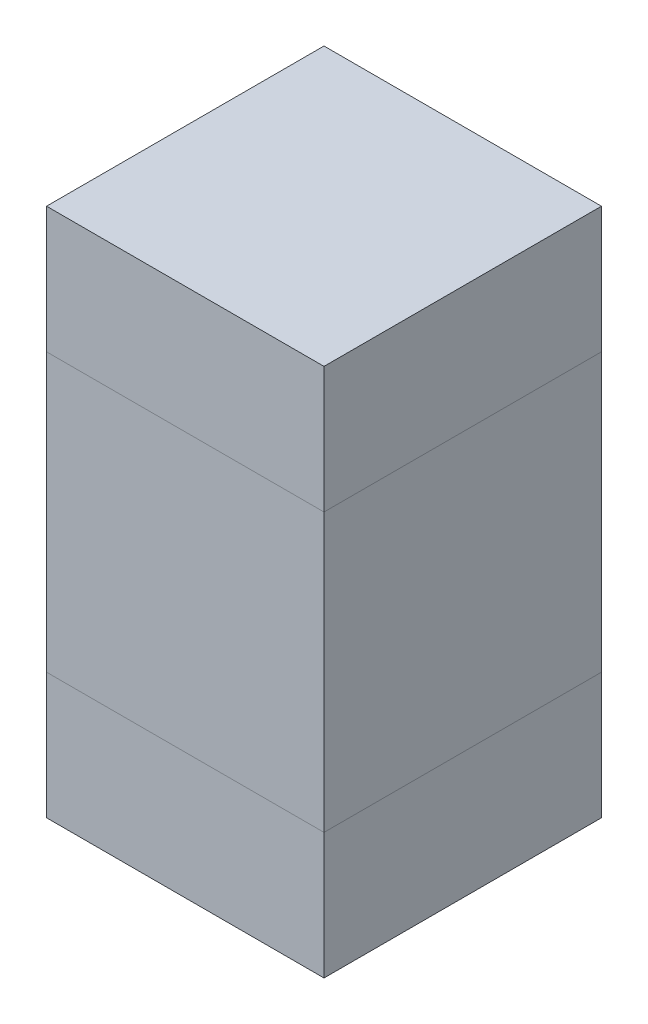
ISO-10303-21;
HEADER;
FILE_DESCRIPTION(('STEP AP214'),'2;1');
FILE_NAME('part.step','',(''),(''),'','','');
FILE_SCHEMA(('AUTOMOTIVE_DESIGN { 1 0 10303 214 1 1 1 1 }'));
ENDSEC;
DATA;
#1=APPLICATION_CONTEXT('core data for automotive mechanical design processes');
#2=APPLICATION_PROTOCOL_DEFINITION('international standard','automotive_design',2000,#1);
#3=PRODUCT_CONTEXT('',#1,'mechanical');
#4=PRODUCT('Part','Part','',(#3));
#5=PRODUCT_RELATED_PRODUCT_CATEGORY('part','',(#4));
#6=PRODUCT_DEFINITION_FORMATION('','',#4);
#7=PRODUCT_DEFINITION_CONTEXT('part definition',#1,'design');
#8=PRODUCT_DEFINITION('design','',#6,#7);
#9=PRODUCT_DEFINITION_SHAPE('','',#8);
#10=(LENGTH_UNIT() NAMED_UNIT(*) SI_UNIT(.MILLI.,.METRE.));
#11=(NAMED_UNIT(*) PLANE_ANGLE_UNIT() SI_UNIT($,.RADIAN.));
#12=(NAMED_UNIT(*) SI_UNIT($,.STERADIAN.) SOLID_ANGLE_UNIT());
#13=UNCERTAINTY_MEASURE_WITH_UNIT(LENGTH_MEASURE(1.E-05),#10,'distance_accuracy_value','');
#14=(GEOMETRIC_REPRESENTATION_CONTEXT(3) GLOBAL_UNCERTAINTY_ASSIGNED_CONTEXT((#13)) GLOBAL_UNIT_ASSIGNED_CONTEXT((#10,
#11,#12)) REPRESENTATION_CONTEXT('',''));
#15=CARTESIAN_POINT('',(0.,0.,0.));
#16=DIRECTION('',(0.,0.,1.));
#17=DIRECTION('',(1.,0.,0.));
#18=AXIS2_PLACEMENT_3D('',#15,#16,#17);
#19=CARTESIAN_POINT('',(3.210000129453,9.839999169844,0.32999934));
#20=DIRECTION('',(0.,0.,-1.));
#21=DIRECTION('',(0.,-1.,0.));
#22=AXIS2_PLACEMENT_3D('',#19,#20,#21);
#23=PLANE('',#22);
#24=DIRECTION('',(1.,0.,0.));
#25=VECTOR('',#24,1.);
#26=CARTESIAN_POINT('',(3.210000129453,9.839999169844,0.32999934));
#27=LINE('',#26,#25);
#28=CARTESIAN_POINT('',(3.210000129453,9.839999169844,0.32999934));
#29=VERTEX_POINT('',#28);
#30=CARTESIAN_POINT('',(3.540002009453,9.839999169844,0.32999934));
#31=VERTEX_POINT('',#30);
#32=EDGE_CURVE('P0_E93',#29,#31,#27,.T.);
#33=ORIENTED_EDGE('',*,*,#32,.T.);
#34=DIRECTION('',(0.,1.,0.));
#35=VECTOR('',#34,1.);
#36=CARTESIAN_POINT('',(3.540002009453,9.839999169844,0.32999934));
#37=LINE('',#36,#35);
#38=CARTESIAN_POINT('',(3.540002009453,9.989998869844,0.32999934));
#39=VERTEX_POINT('',#38);
#40=EDGE_CURVE('P0_E71',#31,#39,#37,.T.);
#41=ORIENTED_EDGE('',*,*,#40,.T.);
#42=DIRECTION('',(-1.,0.,0.));
#43=VECTOR('',#42,1.);
#44=CARTESIAN_POINT('',(3.540002009453,9.989998869844,0.32999934));
#45=LINE('',#44,#43);
#46=CARTESIAN_POINT('',(3.210000129453,9.989998869844,0.32999934));
#47=VERTEX_POINT('',#46);
#48=EDGE_CURVE('P0_E76',#39,#47,#45,.T.);
#49=ORIENTED_EDGE('',*,*,#48,.T.);
#50=DIRECTION('',(0.,-1.,0.));
#51=VECTOR('',#50,1.);
#52=CARTESIAN_POINT('',(3.210000129453,9.989998869844,0.32999934));
#53=LINE('',#52,#51);
#54=EDGE_CURVE('P0_E11',#47,#29,#53,.T.);
#55=ORIENTED_EDGE('',*,*,#54,.T.);
#56=EDGE_LOOP('',(#33,#41,#49,#55));
#57=FACE_BOUND('',#56,.T.);
#58=ADVANCED_FACE('P0_F17',(#57),#23,.F.);
#59=CARTESIAN_POINT('',(3.210000129453,9.839999169844,0.));
#60=DIRECTION('',(0.,0.,-1.));
#61=DIRECTION('',(0.,-1.,0.));
#62=AXIS2_PLACEMENT_3D('',#59,#60,#61);
#63=PLANE('',#62);
#64=DIRECTION('',(0.,-1.,0.));
#65=VECTOR('',#64,1.);
#66=CARTESIAN_POINT('',(3.210000129453,9.989998869844,0.));
#67=LINE('',#66,#65);
#68=CARTESIAN_POINT('',(3.210000129453,9.989998869844,0.));
#69=VERTEX_POINT('',#68);
#70=CARTESIAN_POINT('',(3.210000129453,9.839999169844,0.));
#71=VERTEX_POINT('',#70);
#72=EDGE_CURVE('P0_E25',#69,#71,#67,.T.);
#73=ORIENTED_EDGE('',*,*,#72,.F.);
#74=DIRECTION('',(-1.,0.,0.));
#75=VECTOR('',#74,1.);
#76=CARTESIAN_POINT('',(3.540002009453,9.989998869844,0.));
#77=LINE('',#76,#75);
#78=CARTESIAN_POINT('',(3.540002009453,9.989998869844,0.));
#79=VERTEX_POINT('',#78);
#80=EDGE_CURVE('P0_E60',#79,#69,#77,.T.);
#81=ORIENTED_EDGE('',*,*,#80,.F.);
#82=DIRECTION('',(0.,1.,0.));
#83=VECTOR('',#82,1.);
#84=CARTESIAN_POINT('',(3.540002009453,9.839999169844,0.));
#85=LINE('',#84,#83);
#86=CARTESIAN_POINT('',(3.540002009453,9.839999169844,0.));
#87=VERTEX_POINT('',#86);
#88=EDGE_CURVE('P0_E65',#87,#79,#85,.T.);
#89=ORIENTED_EDGE('',*,*,#88,.F.);
#90=DIRECTION('',(1.,0.,0.));
#91=VECTOR('',#90,1.);
#92=CARTESIAN_POINT('',(3.210000129453,9.839999169844,0.));
#93=LINE('',#92,#91);
#94=EDGE_CURVE('P0_E114',#71,#87,#93,.T.);
#95=ORIENTED_EDGE('',*,*,#94,.F.);
#96=EDGE_LOOP('',(#73,#81,#89,#95));
#97=FACE_BOUND('',#96,.T.);
#98=ADVANCED_FACE('P0_F62',(#97),#63,.T.);
#99=CARTESIAN_POINT('',(3.210000129453,9.989998869844,0.));
#100=DIRECTION('',(1.,0.,0.));
#101=DIRECTION('',(0.,1.,0.));
#102=AXIS2_PLACEMENT_3D('',#99,#100,#101);
#103=PLANE('',#102);
#104=ORIENTED_EDGE('',*,*,#72,.T.);
#105=DIRECTION('',(0.,0.,1.));
#106=VECTOR('',#105,1.);
#107=CARTESIAN_POINT('',(3.210000129453,9.839999169844,0.));
#108=LINE('',#107,#106);
#109=EDGE_CURVE('P0_E87',#71,#29,#108,.T.);
#110=ORIENTED_EDGE('',*,*,#109,.T.);
#111=ORIENTED_EDGE('',*,*,#54,.F.);
#112=DIRECTION('',(0.,0.,1.));
#113=VECTOR('',#112,1.);
#114=CARTESIAN_POINT('',(3.210000129453,9.989998869844,0.));
#115=LINE('',#114,#113);
#116=EDGE_CURVE('P0_E70',#69,#47,#115,.T.);
#117=ORIENTED_EDGE('',*,*,#116,.F.);
#118=EDGE_LOOP('',(#104,#110,#111,#117));
#119=FACE_BOUND('',#118,.T.);
#120=ADVANCED_FACE('P0_F106',(#119),#103,.F.);
#121=CARTESIAN_POINT('',(3.540002009453,9.989998869844,0.));
#122=DIRECTION('',(0.,-1.,0.));
#123=DIRECTION('',(0.,0.,-1.));
#124=AXIS2_PLACEMENT_3D('',#121,#122,#123);
#125=PLANE('',#124);
#126=ORIENTED_EDGE('',*,*,#80,.T.);
#127=ORIENTED_EDGE('',*,*,#116,.T.);
#128=ORIENTED_EDGE('',*,*,#48,.F.);
#129=DIRECTION('',(0.,0.,1.));
#130=VECTOR('',#129,1.);
#131=CARTESIAN_POINT('',(3.540002009453,9.989998869844,0.));
#132=LINE('',#131,#130);
#133=EDGE_CURVE('P0_E74',#79,#39,#132,.T.);
#134=ORIENTED_EDGE('',*,*,#133,.F.);
#135=EDGE_LOOP('',(#126,#127,#128,#134));
#136=FACE_BOUND('',#135,.T.);
#137=ADVANCED_FACE('P0_F75',(#136),#125,.F.);
#138=CARTESIAN_POINT('',(3.540002009453,9.839999169844,0.));
#139=DIRECTION('',(-1.,0.,0.));
#140=DIRECTION('',(0.,0.,1.));
#141=AXIS2_PLACEMENT_3D('',#138,#139,#140);
#142=PLANE('',#141);
#143=ORIENTED_EDGE('',*,*,#88,.T.);
#144=ORIENTED_EDGE('',*,*,#133,.T.);
#145=ORIENTED_EDGE('',*,*,#40,.F.);
#146=DIRECTION('',(0.,0.,1.));
#147=VECTOR('',#146,1.);
#148=CARTESIAN_POINT('',(3.540002009453,9.839999169844,0.));
#149=LINE('',#148,#147);
#150=EDGE_CURVE('P0_E84',#87,#31,#149,.T.);
#151=ORIENTED_EDGE('',*,*,#150,.F.);
#152=EDGE_LOOP('',(#143,#144,#145,#151));
#153=FACE_BOUND('',#152,.T.);
#154=ADVANCED_FACE('P0_F82',(#153),#142,.F.);
#155=CARTESIAN_POINT('',(3.210000129453,9.839999169844,0.));
#156=DIRECTION('',(0.,1.,0.));
#157=DIRECTION('',(1.,0.,0.));
#158=AXIS2_PLACEMENT_3D('',#155,#156,#157);
#159=PLANE('',#158);
#160=ORIENTED_EDGE('',*,*,#94,.T.);
#161=ORIENTED_EDGE('',*,*,#150,.T.);
#162=ORIENTED_EDGE('',*,*,#32,.F.);
#163=ORIENTED_EDGE('',*,*,#109,.F.);
#164=EDGE_LOOP('',(#160,#161,#162,#163));
#165=FACE_BOUND('',#164,.T.);
#166=ADVANCED_FACE('P0_F113',(#165),#159,.F.);
#167=CLOSED_SHELL('',(#58,#98,#120,#137,#154,#166));
#168=MANIFOLD_SOLID_BREP('P0_B1',#167);
#169=CARTESIAN_POINT('',(3.210000129453,9.360003442305,0.32999934));
#170=DIRECTION('',(0.,0.,-1.));
#171=DIRECTION('',(0.,-1.,0.));
#172=AXIS2_PLACEMENT_3D('',#169,#170,#171);
#173=PLANE('',#172);
#174=DIRECTION('',(1.,0.,0.));
#175=VECTOR('',#174,1.);
#176=CARTESIAN_POINT('',(3.210000129453,9.360003442305,0.32999934));
#177=LINE('',#176,#175);
#178=CARTESIAN_POINT('',(3.210000129453,9.360003442305,0.32999934));
#179=VERTEX_POINT('',#178);
#180=CARTESIAN_POINT('',(3.540002009453,9.360003442305,0.32999934));
#181=VERTEX_POINT('',#180);
#182=EDGE_CURVE('P1_E95',#179,#181,#177,.T.);
#183=ORIENTED_EDGE('',*,*,#182,.T.);
#184=DIRECTION('',(0.,1.,0.));
#185=VECTOR('',#184,1.);
#186=CARTESIAN_POINT('',(3.540002009453,9.360003442305,0.32999934));
#187=LINE('',#186,#185);
#188=CARTESIAN_POINT('',(3.540002009453,9.510003142305,0.32999934));
#189=VERTEX_POINT('',#188);
#190=EDGE_CURVE('P1_E74',#181,#189,#187,.T.);
#191=ORIENTED_EDGE('',*,*,#190,.T.);
#192=DIRECTION('',(-1.,0.,0.));
#193=VECTOR('',#192,1.);
#194=CARTESIAN_POINT('',(3.540002009453,9.510003142305,0.32999934));
#195=LINE('',#194,#193);
#196=CARTESIAN_POINT('',(3.210000129453,9.510003142305,0.32999934));
#197=VERTEX_POINT('',#196);
#198=EDGE_CURVE('P1_E79',#189,#197,#195,.T.);
#199=ORIENTED_EDGE('',*,*,#198,.T.);
#200=DIRECTION('',(0.,-1.,0.));
#201=VECTOR('',#200,1.);
#202=CARTESIAN_POINT('',(3.210000129453,9.510003142305,0.32999934));
#203=LINE('',#202,#201);
#204=EDGE_CURVE('P1_E11',#197,#179,#203,.T.);
#205=ORIENTED_EDGE('',*,*,#204,.T.);
#206=EDGE_LOOP('',(#183,#191,#199,#205));
#207=FACE_BOUND('',#206,.T.);
#208=ADVANCED_FACE('P1_F17',(#207),#173,.F.);
#209=CARTESIAN_POINT('',(3.210000129453,9.360003442305,0.));
#210=DIRECTION('',(0.,0.,-1.));
#211=DIRECTION('',(0.,-1.,0.));
#212=AXIS2_PLACEMENT_3D('',#209,#210,#211);
#213=PLANE('',#212);
#214=DIRECTION('',(0.,-1.,0.));
#215=VECTOR('',#214,1.);
#216=CARTESIAN_POINT('',(3.210000129453,9.510003142305,0.));
#217=LINE('',#216,#215);
#218=CARTESIAN_POINT('',(3.210000129453,9.510003142305,0.));
#219=VERTEX_POINT('',#218);
#220=CARTESIAN_POINT('',(3.210000129453,9.360003442305,0.));
#221=VERTEX_POINT('',#220);
#222=EDGE_CURVE('P1_E26',#219,#221,#217,.T.);
#223=ORIENTED_EDGE('',*,*,#222,.F.);
#224=DIRECTION('',(-1.,0.,0.));
#225=VECTOR('',#224,1.);
#226=CARTESIAN_POINT('',(3.540002009453,9.510003142305,0.));
#227=LINE('',#226,#225);
#228=CARTESIAN_POINT('',(3.540002009453,9.510003142305,0.));
#229=VERTEX_POINT('',#228);
#230=EDGE_CURVE('P1_E62',#229,#219,#227,.T.);
#231=ORIENTED_EDGE('',*,*,#230,.F.);
#232=DIRECTION('',(0.,1.,0.));
#233=VECTOR('',#232,1.);
#234=CARTESIAN_POINT('',(3.540002009453,9.360003442305,0.));
#235=LINE('',#234,#233);
#236=CARTESIAN_POINT('',(3.540002009453,9.360003442305,0.));
#237=VERTEX_POINT('',#236);
#238=EDGE_CURVE('P1_E67',#237,#229,#235,.T.);
#239=ORIENTED_EDGE('',*,*,#238,.F.);
#240=DIRECTION('',(1.,0.,0.));
#241=VECTOR('',#240,1.);
#242=CARTESIAN_POINT('',(3.210000129453,9.360003442305,0.));
#243=LINE('',#242,#241);
#244=EDGE_CURVE('P1_E111',#221,#237,#243,.T.);
#245=ORIENTED_EDGE('',*,*,#244,.F.);
#246=EDGE_LOOP('',(#223,#231,#239,#245));
#247=FACE_BOUND('',#246,.T.);
#248=ADVANCED_FACE('P1_F64',(#247),#213,.T.);
#249=CARTESIAN_POINT('',(3.210000129453,9.510003142305,0.));
#250=DIRECTION('',(1.,0.,0.));
#251=DIRECTION('',(0.,1.,0.));
#252=AXIS2_PLACEMENT_3D('',#249,#250,#251);
#253=PLANE('',#252);
#254=ORIENTED_EDGE('',*,*,#222,.T.);
#255=DIRECTION('',(0.,0.,1.));
#256=VECTOR('',#255,1.);
#257=CARTESIAN_POINT('',(3.210000129453,9.360003442305,0.));
#258=LINE('',#257,#256);
#259=EDGE_CURVE('P1_E89',#221,#179,#258,.T.);
#260=ORIENTED_EDGE('',*,*,#259,.T.);
#261=ORIENTED_EDGE('',*,*,#204,.F.);
#262=DIRECTION('',(0.,0.,1.));
#263=VECTOR('',#262,1.);
#264=CARTESIAN_POINT('',(3.210000129453,9.510003142305,0.));
#265=LINE('',#264,#263);
#266=EDGE_CURVE('P1_E73',#219,#197,#265,.T.);
#267=ORIENTED_EDGE('',*,*,#266,.F.);
#268=EDGE_LOOP('',(#254,#260,#261,#267));
#269=FACE_BOUND('',#268,.T.);
#270=ADVANCED_FACE('P1_F107',(#269),#253,.F.);
#271=CARTESIAN_POINT('',(3.540002009453,9.510003142305,0.));
#272=DIRECTION('',(0.,-1.,0.));
#273=DIRECTION('',(0.,0.,-1.));
#274=AXIS2_PLACEMENT_3D('',#271,#272,#273);
#275=PLANE('',#274);
#276=ORIENTED_EDGE('',*,*,#230,.T.);
#277=ORIENTED_EDGE('',*,*,#266,.T.);
#278=ORIENTED_EDGE('',*,*,#198,.F.);
#279=DIRECTION('',(0.,0.,1.));
#280=VECTOR('',#279,1.);
#281=CARTESIAN_POINT('',(3.540002009453,9.510003142305,0.));
#282=LINE('',#281,#280);
#283=EDGE_CURVE('P1_E77',#229,#189,#282,.T.);
#284=ORIENTED_EDGE('',*,*,#283,.F.);
#285=EDGE_LOOP('',(#276,#277,#278,#284));
#286=FACE_BOUND('',#285,.T.);
#287=ADVANCED_FACE('P1_F78',(#286),#275,.F.);
#288=CARTESIAN_POINT('',(3.540002009453,9.360003442305,0.));
#289=DIRECTION('',(-1.,0.,0.));
#290=DIRECTION('',(0.,0.,1.));
#291=AXIS2_PLACEMENT_3D('',#288,#289,#290);
#292=PLANE('',#291);
#293=ORIENTED_EDGE('',*,*,#238,.T.);
#294=ORIENTED_EDGE('',*,*,#283,.T.);
#295=ORIENTED_EDGE('',*,*,#190,.F.);
#296=DIRECTION('',(0.,0.,1.));
#297=VECTOR('',#296,1.);
#298=CARTESIAN_POINT('',(3.540002009453,9.360003442305,0.));
#299=LINE('',#298,#297);
#300=EDGE_CURVE('P1_E86',#237,#181,#299,.T.);
#301=ORIENTED_EDGE('',*,*,#300,.F.);
#302=EDGE_LOOP('',(#293,#294,#295,#301));
#303=FACE_BOUND('',#302,.T.);
#304=ADVANCED_FACE('P1_F84',(#303),#292,.F.);
#305=CARTESIAN_POINT('',(3.210000129453,9.360003442305,0.));
#306=DIRECTION('',(0.,1.,0.));
#307=DIRECTION('',(1.,0.,0.));
#308=AXIS2_PLACEMENT_3D('',#305,#306,#307);
#309=PLANE('',#308);
#310=ORIENTED_EDGE('',*,*,#244,.T.);
#311=ORIENTED_EDGE('',*,*,#300,.T.);
#312=ORIENTED_EDGE('',*,*,#182,.F.);
#313=ORIENTED_EDGE('',*,*,#259,.F.);
#314=EDGE_LOOP('',(#310,#311,#312,#313));
#315=FACE_BOUND('',#314,.T.);
#316=ADVANCED_FACE('P1_F110',(#315),#309,.F.);
#317=CLOSED_SHELL('',(#208,#248,#270,#287,#304,#316));
#318=MANIFOLD_SOLID_BREP('P1_B1',#317);
#319=CARTESIAN_POINT('',(3.210000129453,9.510001486074,0.32999934));
#320=DIRECTION('',(0.,0.,-1.));
#321=DIRECTION('',(0.,-1.,0.));
#322=AXIS2_PLACEMENT_3D('',#319,#320,#321);
#323=PLANE('',#322);
#324=DIRECTION('',(1.,0.,0.));
#325=VECTOR('',#324,1.);
#326=CARTESIAN_POINT('',(3.210000129453,9.510001486074,0.32999934));
#327=LINE('',#326,#325);
#328=CARTESIAN_POINT('',(3.210000129453,9.510001486074,0.32999934));
#329=VERTEX_POINT('',#328);
#330=CARTESIAN_POINT('',(3.540002009453,9.510001486074,0.32999934));
#331=VERTEX_POINT('',#330);
#332=EDGE_CURVE('P2_E83',#329,#331,#327,.T.);
#333=ORIENTED_EDGE('',*,*,#332,.T.);
#334=DIRECTION('',(0.,1.,0.));
#335=VECTOR('',#334,1.);
#336=CARTESIAN_POINT('',(3.540002009453,9.510001486074,0.32999934));
#337=LINE('',#336,#335);
#338=CARTESIAN_POINT('',(3.540002009453,9.840000826074,0.32999934));
#339=VERTEX_POINT('',#338);
#340=EDGE_CURVE('P2_E106',#331,#339,#337,.T.);
#341=ORIENTED_EDGE('',*,*,#340,.T.);
#342=DIRECTION('',(-1.,0.,0.));
#343=VECTOR('',#342,1.);
#344=CARTESIAN_POINT('',(3.540002009453,9.840000826074,0.32999934));
#345=LINE('',#344,#343);
#346=CARTESIAN_POINT('',(3.210000129453,9.840000826074,0.32999934));
#347=VERTEX_POINT('',#346);
#348=EDGE_CURVE('P2_E75',#339,#347,#345,.T.);
#349=ORIENTED_EDGE('',*,*,#348,.T.);
#350=DIRECTION('',(0.,-1.,0.));
#351=VECTOR('',#350,1.);
#352=CARTESIAN_POINT('',(3.210000129453,9.840000826074,0.32999934));
#353=LINE('',#352,#351);
#354=EDGE_CURVE('P2_E11',#347,#329,#353,.T.);
#355=ORIENTED_EDGE('',*,*,#354,.T.);
#356=EDGE_LOOP('',(#333,#341,#349,#355));
#357=FACE_BOUND('',#356,.T.);
#358=ADVANCED_FACE('P2_F17',(#357),#323,.F.);
#359=CARTESIAN_POINT('',(3.210000129453,9.510001486074,0.));
#360=DIRECTION('',(0.,0.,-1.));
#361=DIRECTION('',(0.,-1.,0.));
#362=AXIS2_PLACEMENT_3D('',#359,#360,#361);
#363=PLANE('',#362);
#364=DIRECTION('',(0.,-1.,0.));
#365=VECTOR('',#364,1.);
#366=CARTESIAN_POINT('',(3.210000129453,9.840000826074,0.));
#367=LINE('',#366,#365);
#368=CARTESIAN_POINT('',(3.210000129453,9.840000826074,0.));
#369=VERTEX_POINT('',#368);
#370=CARTESIAN_POINT('',(3.210000129453,9.510001486074,0.));
#371=VERTEX_POINT('',#370);
#372=EDGE_CURVE('P2_E26',#369,#371,#367,.T.);
#373=ORIENTED_EDGE('',*,*,#372,.F.);
#374=DIRECTION('',(-1.,0.,0.));
#375=VECTOR('',#374,1.);
#376=CARTESIAN_POINT('',(3.540002009453,9.840000826074,0.));
#377=LINE('',#376,#375);
#378=CARTESIAN_POINT('',(3.540002009453,9.840000826074,0.));
#379=VERTEX_POINT('',#378);
#380=EDGE_CURVE('P2_E110',#379,#369,#377,.T.);
#381=ORIENTED_EDGE('',*,*,#380,.F.);
#382=DIRECTION('',(0.,1.,0.));
#383=VECTOR('',#382,1.);
#384=CARTESIAN_POINT('',(3.540002009453,9.510001486074,0.));
#385=LINE('',#384,#383);
#386=CARTESIAN_POINT('',(3.540002009453,9.510001486074,0.));
#387=VERTEX_POINT('',#386);
#388=EDGE_CURVE('P2_E85',#387,#379,#385,.T.);
#389=ORIENTED_EDGE('',*,*,#388,.F.);
#390=DIRECTION('',(1.,0.,0.));
#391=VECTOR('',#390,1.);
#392=CARTESIAN_POINT('',(3.210000129453,9.510001486074,0.));
#393=LINE('',#392,#391);
#394=EDGE_CURVE('P2_E81',#371,#387,#393,.T.);
#395=ORIENTED_EDGE('',*,*,#394,.F.);
#396=EDGE_LOOP('',(#373,#381,#389,#395));
#397=FACE_BOUND('',#396,.T.);
#398=ADVANCED_FACE('P2_F19',(#397),#363,.T.);
#399=CARTESIAN_POINT('',(3.210000129453,9.840000826074,0.));
#400=DIRECTION('',(1.,0.,0.));
#401=DIRECTION('',(0.,1.,0.));
#402=AXIS2_PLACEMENT_3D('',#399,#400,#401);
#403=PLANE('',#402);
#404=ORIENTED_EDGE('',*,*,#372,.T.);
#405=DIRECTION('',(0.,0.,1.));
#406=VECTOR('',#405,1.);
#407=CARTESIAN_POINT('',(3.210000129453,9.510001486074,0.));
#408=LINE('',#407,#406);
#409=EDGE_CURVE('P2_E69',#371,#329,#408,.T.);
#410=ORIENTED_EDGE('',*,*,#409,.T.);
#411=ORIENTED_EDGE('',*,*,#354,.F.);
#412=DIRECTION('',(0.,0.,1.));
#413=VECTOR('',#412,1.);
#414=CARTESIAN_POINT('',(3.210000129453,9.840000826074,0.));
#415=LINE('',#414,#413);
#416=EDGE_CURVE('P2_E72',#369,#347,#415,.T.);
#417=ORIENTED_EDGE('',*,*,#416,.F.);
#418=EDGE_LOOP('',(#404,#410,#411,#417));
#419=FACE_BOUND('',#418,.T.);
#420=ADVANCED_FACE('P2_F68',(#419),#403,.F.);
#421=CARTESIAN_POINT('',(3.540002009453,9.840000826074,0.));
#422=DIRECTION('',(0.,-1.,0.));
#423=DIRECTION('',(0.,0.,-1.));
#424=AXIS2_PLACEMENT_3D('',#421,#422,#423);
#425=PLANE('',#424);
#426=ORIENTED_EDGE('',*,*,#380,.T.);
#427=ORIENTED_EDGE('',*,*,#416,.T.);
#428=ORIENTED_EDGE('',*,*,#348,.F.);
#429=DIRECTION('',(0.,0.,1.));
#430=VECTOR('',#429,1.);
#431=CARTESIAN_POINT('',(3.540002009453,9.840000826074,0.));
#432=LINE('',#431,#430);
#433=EDGE_CURVE('P2_E99',#379,#339,#432,.T.);
#434=ORIENTED_EDGE('',*,*,#433,.F.);
#435=EDGE_LOOP('',(#426,#427,#428,#434));
#436=FACE_BOUND('',#435,.T.);
#437=ADVANCED_FACE('P2_F118',(#436),#425,.F.);
#438=CARTESIAN_POINT('',(3.540002009453,9.510001486074,0.));
#439=DIRECTION('',(-1.,0.,0.));
#440=DIRECTION('',(0.,0.,1.));
#441=AXIS2_PLACEMENT_3D('',#438,#439,#440);
#442=PLANE('',#441);
#443=ORIENTED_EDGE('',*,*,#388,.T.);
#444=ORIENTED_EDGE('',*,*,#433,.T.);
#445=ORIENTED_EDGE('',*,*,#340,.F.);
#446=DIRECTION('',(0.,0.,1.));
#447=VECTOR('',#446,1.);
#448=CARTESIAN_POINT('',(3.540002009453,9.510001486074,0.));
#449=LINE('',#448,#447);
#450=EDGE_CURVE('P2_E90',#387,#331,#449,.T.);
#451=ORIENTED_EDGE('',*,*,#450,.F.);
#452=EDGE_LOOP('',(#443,#444,#445,#451));
#453=FACE_BOUND('',#452,.T.);
#454=ADVANCED_FACE('P2_F120',(#453),#442,.F.);
#455=CARTESIAN_POINT('',(3.210000129453,9.510001486074,0.));
#456=DIRECTION('',(0.,1.,0.));
#457=DIRECTION('',(1.,0.,0.));
#458=AXIS2_PLACEMENT_3D('',#455,#456,#457);
#459=PLANE('',#458);
#460=ORIENTED_EDGE('',*,*,#394,.T.);
#461=ORIENTED_EDGE('',*,*,#450,.T.);
#462=ORIENTED_EDGE('',*,*,#332,.F.);
#463=ORIENTED_EDGE('',*,*,#409,.F.);
#464=EDGE_LOOP('',(#460,#461,#462,#463));
#465=FACE_BOUND('',#464,.T.);
#466=ADVANCED_FACE('P2_F79',(#465),#459,.F.);
#467=CLOSED_SHELL('',(#358,#398,#420,#437,#454,#466));
#468=MANIFOLD_SOLID_BREP('P2_B1',#467);
#469=ADVANCED_BREP_SHAPE_REPRESENTATION('',(#18,#168,#318,#468),#14);
#470=SHAPE_DEFINITION_REPRESENTATION(#9,#469);
ENDSEC;
END-ISO-10303-21;
